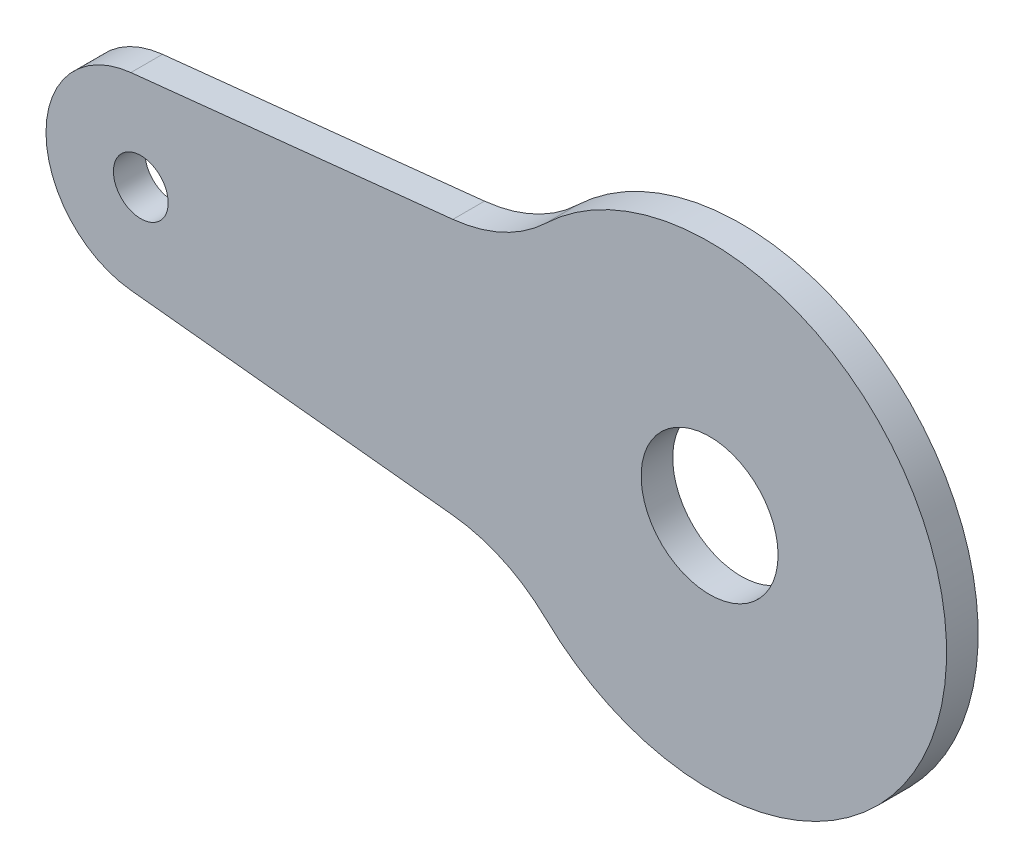
ISO-10303-21;
HEADER;
FILE_DESCRIPTION(('STEP AP214'),'2;1');
FILE_NAME('part.step','',(''),(''),'','','');
FILE_SCHEMA(('AUTOMOTIVE_DESIGN { 1 0 10303 214 1 1 1 1 }'));
ENDSEC;
DATA;
#1=APPLICATION_CONTEXT('core data for automotive mechanical design processes');
#2=APPLICATION_PROTOCOL_DEFINITION('international standard','automotive_design',2000,#1);
#3=PRODUCT_CONTEXT('',#1,'mechanical');
#4=PRODUCT('Part','Part','',(#3));
#5=PRODUCT_RELATED_PRODUCT_CATEGORY('part','',(#4));
#6=PRODUCT_DEFINITION_FORMATION('','',#4);
#7=PRODUCT_DEFINITION_CONTEXT('part definition',#1,'design');
#8=PRODUCT_DEFINITION('design','',#6,#7);
#9=PRODUCT_DEFINITION_SHAPE('','',#8);
#10=(LENGTH_UNIT() NAMED_UNIT(*) SI_UNIT(.MILLI.,.METRE.));
#11=(NAMED_UNIT(*) PLANE_ANGLE_UNIT() SI_UNIT($,.RADIAN.));
#12=(NAMED_UNIT(*) SI_UNIT($,.STERADIAN.) SOLID_ANGLE_UNIT());
#13=UNCERTAINTY_MEASURE_WITH_UNIT(LENGTH_MEASURE(1.E-05),#10,'distance_accuracy_value','');
#14=(GEOMETRIC_REPRESENTATION_CONTEXT(3) GLOBAL_UNCERTAINTY_ASSIGNED_CONTEXT((#13)) GLOBAL_UNIT_ASSIGNED_CONTEXT((#10,
#11,#12)) REPRESENTATION_CONTEXT('',''));
#15=CARTESIAN_POINT('',(0.,0.,0.));
#16=DIRECTION('',(0.,0.,1.));
#17=DIRECTION('',(1.,0.,0.));
#18=AXIS2_PLACEMENT_3D('',#15,#16,#17);
#19=CARTESIAN_POINT('',(-54.9407561694089,-8.95069705831446,5.));
#20=DIRECTION('',(0.104528463267653,0.994521895368273,0.));
#21=DIRECTION('',(-0.994521895368273,0.104528463267653,0.));
#22=AXIS2_PLACEMENT_3D('',#19,#20,#21);
#23=PLANE('',#22);
#24=DIRECTION('',(0.994521895368273,-0.104528463267653,0.));
#25=VECTOR('',#24,1.);
#26=CARTESIAN_POINT('',(-54.9407561694089,-8.95069705831446,0.));
#27=LINE('',#26,#25);
#28=CARTESIAN_POINT('',(-54.9407561694089,-8.95069705831446,0.));
#29=VERTEX_POINT('',#28);
#30=CARTESIAN_POINT('',(-24.3712697513505,-12.163679550749,0.));
#31=VERTEX_POINT('',#30);
#32=EDGE_CURVE('E112',#29,#31,#27,.T.);
#33=ORIENTED_EDGE('',*,*,#32,.T.);
#34=DIRECTION('',(0.,0.,1.));
#35=VECTOR('',#34,1.);
#36=CARTESIAN_POINT('',(-24.3712697513505,-12.163679550749,5.));
#37=LINE('',#36,#35);
#38=CARTESIAN_POINT('',(-24.3712697513505,-12.163679550749,3.));
#39=VERTEX_POINT('',#38);
#40=EDGE_CURVE('E89',#31,#39,#37,.T.);
#41=ORIENTED_EDGE('',*,*,#40,.T.);
#42=DIRECTION('',(-0.994521895368273,0.104528463267653,0.));
#43=VECTOR('',#42,1.);
#44=CARTESIAN_POINT('',(-54.9407561694089,-8.95069705831446,3.));
#45=LINE('',#44,#43);
#46=CARTESIAN_POINT('',(-54.9407561694089,-8.95069705831446,3.));
#47=VERTEX_POINT('',#46);
#48=EDGE_CURVE('E85',#39,#47,#45,.T.);
#49=ORIENTED_EDGE('',*,*,#48,.T.);
#50=DIRECTION('',(0.,0.,1.));
#51=VECTOR('',#50,1.);
#52=CARTESIAN_POINT('',(-54.9407561694089,-8.95069705831446,5.));
#53=LINE('',#52,#51);
#54=EDGE_CURVE('E88',#29,#47,#53,.T.);
#55=ORIENTED_EDGE('',*,*,#54,.F.);
#56=EDGE_LOOP('',(#33,#41,#49,#55));
#57=FACE_BOUND('',#56,.T.);
#58=ADVANCED_FACE('F33',(#57),#23,.F.);
#59=CARTESIAN_POINT('',(-54.9407561694089,8.95069705831445,5.));
#60=DIRECTION('',(0.104528463267654,-0.994521895368273,0.));
#61=DIRECTION('',(0.994521895368273,0.104528463267654,0.));
#62=AXIS2_PLACEMENT_3D('',#59,#60,#61);
#63=PLANE('',#62);
#64=DIRECTION('',(0.994521895368273,0.104528463267654,0.));
#65=VECTOR('',#64,1.);
#66=CARTESIAN_POINT('',(-54.9407561694089,8.95069705831445,3.));
#67=LINE('',#66,#65);
#68=CARTESIAN_POINT('',(-54.9407561694089,8.95069705831446,3.));
#69=VERTEX_POINT('',#68);
#70=CARTESIAN_POINT('',(-24.3712697513505,12.163679550749,3.));
#71=VERTEX_POINT('',#70);
#72=EDGE_CURVE('E91',#69,#71,#67,.T.);
#73=ORIENTED_EDGE('',*,*,#72,.T.);
#74=DIRECTION('',(0.,0.,1.));
#75=VECTOR('',#74,1.);
#76=CARTESIAN_POINT('',(-24.3712697513505,12.163679550749,5.));
#77=LINE('',#76,#75);
#78=CARTESIAN_POINT('',(-24.3712697513505,12.163679550749,0.));
#79=VERTEX_POINT('',#78);
#80=EDGE_CURVE('E100',#71,#79,#77,.F.);
#81=ORIENTED_EDGE('',*,*,#80,.T.);
#82=DIRECTION('',(-0.994521895368273,-0.104528463267654,0.));
#83=VECTOR('',#82,1.);
#84=CARTESIAN_POINT('',(-15.0197081139881,13.1465682851838,0.));
#85=LINE('',#84,#83);
#86=CARTESIAN_POINT('',(-54.9407561694089,8.95069705831446,0.));
#87=VERTEX_POINT('',#86);
#88=EDGE_CURVE('E101',#79,#87,#85,.T.);
#89=ORIENTED_EDGE('',*,*,#88,.T.);
#90=DIRECTION('',(0.,0.,-1.));
#91=VECTOR('',#90,1.);
#92=CARTESIAN_POINT('',(-54.9407561694089,8.95069705831446,5.));
#93=LINE('',#92,#91);
#94=EDGE_CURVE('E107',#69,#87,#93,.T.);
#95=ORIENTED_EDGE('',*,*,#94,.F.);
#96=EDGE_LOOP('',(#73,#81,#89,#95));
#97=FACE_BOUND('',#96,.T.);
#98=ADVANCED_FACE('F153',(#97),#63,.F.);
#99=CARTESIAN_POINT('',(-54.,0.,5.));
#100=DIRECTION('',(0.,0.,-1.));
#101=DIRECTION('',(-1.,0.,0.));
#102=AXIS2_PLACEMENT_3D('',#99,#100,#101);
#103=CYLINDRICAL_SURFACE('',#102,9.);
#104=CARTESIAN_POINT('',(-54.,0.,3.));
#105=DIRECTION('',(0.,0.,-1.));
#106=DIRECTION('',(-1.,0.,0.));
#107=AXIS2_PLACEMENT_3D('',#104,#105,#106);
#108=CIRCLE('',#107,9.);
#109=EDGE_CURVE('E94',#69,#47,#108,.F.);
#110=ORIENTED_EDGE('',*,*,#109,.F.);
#111=ORIENTED_EDGE('',*,*,#94,.T.);
#112=CARTESIAN_POINT('',(-54.,0.,0.));
#113=DIRECTION('',(0.,0.,-1.));
#114=DIRECTION('',(-1.,0.,0.));
#115=AXIS2_PLACEMENT_3D('',#112,#113,#114);
#116=CIRCLE('',#115,9.);
#117=EDGE_CURVE('E106',#87,#29,#116,.F.);
#118=ORIENTED_EDGE('',*,*,#117,.T.);
#119=ORIENTED_EDGE('',*,*,#54,.T.);
#120=EDGE_LOOP('',(#110,#111,#118,#119));
#121=FACE_BOUND('',#120,.T.);
#122=ADVANCED_FACE('F104',(#121),#103,.T.);
#123=CARTESIAN_POINT('',(-54.,0.,0.));
#124=DIRECTION('',(0.,0.,1.));
#125=DIRECTION('',(1.,0.,0.));
#126=AXIS2_PLACEMENT_3D('',#123,#124,#125);
#127=PLANE('',#126);
#128=CARTESIAN_POINT('',(0.,0.,0.));
#129=DIRECTION('',(0.,0.,1.));
#130=DIRECTION('',(1.,0.,0.));
#131=AXIS2_PLACEMENT_3D('',#128,#129,#130);
#132=CIRCLE('',#131,6.5);
#133=CARTESIAN_POINT('',(6.5,0.,0.));
#134=VERTEX_POINT('',#133);
#135=EDGE_CURVE('E237',#134,#134,#132,.T.);
#136=ORIENTED_EDGE('',*,*,#135,.T.);
#137=EDGE_LOOP('',(#136));
#138=FACE_BOUND('',#137,.T.);
#139=CARTESIAN_POINT('',(-54.,0.,0.));
#140=DIRECTION('',(0.,0.,1.));
#141=DIRECTION('',(1.,0.,0.));
#142=AXIS2_PLACEMENT_3D('',#139,#140,#141);
#143=CIRCLE('',#142,2.6);
#144=CARTESIAN_POINT('',(-51.4,0.,0.));
#145=VERTEX_POINT('',#144);
#146=EDGE_CURVE('E133',#145,#145,#143,.T.);
#147=ORIENTED_EDGE('',*,*,#146,.T.);
#148=EDGE_LOOP('',(#147));
#149=FACE_BOUND('',#148,.T.);
#150=ORIENTED_EDGE('',*,*,#88,.F.);
#151=CARTESIAN_POINT('',(-25.9391967003653,27.0815079812731,0.));
#152=DIRECTION('',(0.,0.,1.));
#153=DIRECTION('',(1.,0.,0.));
#154=AXIS2_PLACEMENT_3D('',#151,#152,#153);
#155=CIRCLE('',#154,15.);
#156=CARTESIAN_POINT('',(-15.5635180202192,16.2489047887639,0.));
#157=VERTEX_POINT('',#156);
#158=EDGE_CURVE('E121',#79,#157,#155,.T.);
#159=ORIENTED_EDGE('',*,*,#158,.T.);
#160=CARTESIAN_POINT('',(0.,0.,0.));
#161=DIRECTION('',(0.,0.,1.));
#162=DIRECTION('',(1.,0.,0.));
#163=AXIS2_PLACEMENT_3D('',#160,#161,#162);
#164=CIRCLE('',#163,22.5);
#165=CARTESIAN_POINT('',(-15.5635180202192,-16.2489047887638,0.));
#166=VERTEX_POINT('',#165);
#167=EDGE_CURVE('E132',#166,#157,#164,.T.);
#168=ORIENTED_EDGE('',*,*,#167,.F.);
#169=CARTESIAN_POINT('',(-25.9391967003653,-27.0815079812731,0.));
#170=DIRECTION('',(0.,0.,1.));
#171=DIRECTION('',(1.,0.,0.));
#172=AXIS2_PLACEMENT_3D('',#169,#170,#171);
#173=CIRCLE('',#172,15.);
#174=EDGE_CURVE('E11',#166,#31,#173,.T.);
#175=ORIENTED_EDGE('',*,*,#174,.T.);
#176=ORIENTED_EDGE('',*,*,#32,.F.);
#177=ORIENTED_EDGE('',*,*,#117,.F.);
#178=EDGE_LOOP('',(#150,#159,#168,#175,#176,#177));
#179=FACE_BOUND('',#178,.T.);
#180=ADVANCED_FACE('F142',(#138,#149,#179),#127,.F.);
#181=CARTESIAN_POINT('',(0.,0.,3.));
#182=DIRECTION('',(0.,0.,-1.));
#183=DIRECTION('',(-1.,0.,0.));
#184=AXIS2_PLACEMENT_3D('',#181,#182,#183);
#185=PLANE('',#184);
#186=CARTESIAN_POINT('',(0.,0.,3.));
#187=DIRECTION('',(0.,0.,1.));
#188=DIRECTION('',(1.,0.,0.));
#189=AXIS2_PLACEMENT_3D('',#186,#187,#188);
#190=CIRCLE('',#189,6.5);
#191=CARTESIAN_POINT('',(6.5,0.,3.));
#192=VERTEX_POINT('',#191);
#193=EDGE_CURVE('E240',#192,#192,#190,.T.);
#194=ORIENTED_EDGE('',*,*,#193,.F.);
#195=EDGE_LOOP('',(#194));
#196=FACE_BOUND('',#195,.T.);
#197=CARTESIAN_POINT('',(-54.,0.,3.));
#198=DIRECTION('',(0.,0.,1.));
#199=DIRECTION('',(1.,0.,0.));
#200=AXIS2_PLACEMENT_3D('',#197,#198,#199);
#201=CIRCLE('',#200,2.6);
#202=CARTESIAN_POINT('',(-51.4,0.,3.));
#203=VERTEX_POINT('',#202);
#204=EDGE_CURVE('E235',#203,#203,#201,.T.);
#205=ORIENTED_EDGE('',*,*,#204,.F.);
#206=EDGE_LOOP('',(#205));
#207=FACE_BOUND('',#206,.T.);
#208=ORIENTED_EDGE('',*,*,#48,.F.);
#209=CARTESIAN_POINT('',(-25.9391967003653,-27.0815079812731,3.));
#210=DIRECTION('',(0.,0.,-1.));
#211=DIRECTION('',(-1.,0.,0.));
#212=AXIS2_PLACEMENT_3D('',#209,#210,#211);
#213=CIRCLE('',#212,15.);
#214=CARTESIAN_POINT('',(-15.5635180202192,-16.2489047887638,3.));
#215=VERTEX_POINT('',#214);
#216=EDGE_CURVE('E41',#39,#215,#213,.T.);
#217=ORIENTED_EDGE('',*,*,#216,.T.);
#218=CARTESIAN_POINT('',(0.,0.,3.));
#219=DIRECTION('',(0.,0.,1.));
#220=DIRECTION('',(1.,0.,0.));
#221=AXIS2_PLACEMENT_3D('',#218,#219,#220);
#222=CIRCLE('',#221,22.5);
#223=CARTESIAN_POINT('',(-15.5635180202192,16.2489047887639,3.));
#224=VERTEX_POINT('',#223);
#225=EDGE_CURVE('E126',#215,#224,#222,.T.);
#226=ORIENTED_EDGE('',*,*,#225,.T.);
#227=CARTESIAN_POINT('',(-25.9391967003653,27.0815079812731,3.));
#228=DIRECTION('',(0.,0.,-1.));
#229=DIRECTION('',(-1.,0.,0.));
#230=AXIS2_PLACEMENT_3D('',#227,#228,#229);
#231=CIRCLE('',#230,15.);
#232=EDGE_CURVE('E123',#224,#71,#231,.T.);
#233=ORIENTED_EDGE('',*,*,#232,.T.);
#234=ORIENTED_EDGE('',*,*,#72,.F.);
#235=ORIENTED_EDGE('',*,*,#109,.T.);
#236=EDGE_LOOP('',(#208,#217,#226,#233,#234,#235));
#237=FACE_BOUND('',#236,.T.);
#238=ADVANCED_FACE('F95',(#196,#207,#237),#185,.F.);
#239=CARTESIAN_POINT('',(0.,0.,0.));
#240=DIRECTION('',(0.,0.,1.));
#241=DIRECTION('',(1.,0.,0.));
#242=AXIS2_PLACEMENT_3D('',#239,#240,#241);
#243=CYLINDRICAL_SURFACE('',#242,22.5);
#244=ORIENTED_EDGE('',*,*,#167,.T.);
#245=DIRECTION('',(0.,0.,1.));
#246=VECTOR('',#245,1.);
#247=CARTESIAN_POINT('',(-15.5635180202192,16.2489047887639,0.));
#248=LINE('',#247,#246);
#249=EDGE_CURVE('E118',#157,#224,#248,.T.);
#250=ORIENTED_EDGE('',*,*,#249,.T.);
#251=ORIENTED_EDGE('',*,*,#225,.F.);
#252=DIRECTION('',(0.,0.,1.));
#253=VECTOR('',#252,1.);
#254=CARTESIAN_POINT('',(-15.5635180202192,-16.2489047887638,0.));
#255=LINE('',#254,#253);
#256=EDGE_CURVE('E116',#215,#166,#255,.F.);
#257=ORIENTED_EDGE('',*,*,#256,.T.);
#258=EDGE_LOOP('',(#244,#250,#251,#257));
#259=FACE_BOUND('',#258,.T.);
#260=ADVANCED_FACE('F130',(#259),#243,.T.);
#261=CARTESIAN_POINT('',(-54.,0.,0.));
#262=DIRECTION('',(0.,0.,1.));
#263=DIRECTION('',(1.,0.,0.));
#264=AXIS2_PLACEMENT_3D('',#261,#262,#263);
#265=CYLINDRICAL_SURFACE('',#264,2.6);
#266=ORIENTED_EDGE('',*,*,#146,.F.);
#267=EDGE_LOOP('',(#266));
#268=FACE_BOUND('',#267,.T.);
#269=ORIENTED_EDGE('',*,*,#204,.T.);
#270=EDGE_LOOP('',(#269));
#271=FACE_BOUND('',#270,.T.);
#272=ADVANCED_FACE('F196',(#268,#271),#265,.F.);
#273=CARTESIAN_POINT('',(0.,0.,0.));
#274=DIRECTION('',(0.,0.,1.));
#275=DIRECTION('',(1.,0.,0.));
#276=AXIS2_PLACEMENT_3D('',#273,#274,#275);
#277=CYLINDRICAL_SURFACE('',#276,6.5);
#278=ORIENTED_EDGE('',*,*,#135,.F.);
#279=EDGE_LOOP('',(#278));
#280=FACE_BOUND('',#279,.T.);
#281=ORIENTED_EDGE('',*,*,#193,.T.);
#282=EDGE_LOOP('',(#281));
#283=FACE_BOUND('',#282,.T.);
#284=ADVANCED_FACE('F140',(#280,#283),#277,.F.);
#285=CARTESIAN_POINT('',(-25.9391967003653,27.0815079812731,0.));
#286=DIRECTION('',(0.,0.,1.));
#287=DIRECTION('',(1.,0.,0.));
#288=AXIS2_PLACEMENT_3D('',#285,#286,#287);
#289=CYLINDRICAL_SURFACE('',#288,15.);
#290=ORIENTED_EDGE('',*,*,#232,.F.);
#291=ORIENTED_EDGE('',*,*,#249,.F.);
#292=ORIENTED_EDGE('',*,*,#158,.F.);
#293=ORIENTED_EDGE('',*,*,#80,.F.);
#294=EDGE_LOOP('',(#290,#291,#292,#293));
#295=FACE_BOUND('',#294,.T.);
#296=ADVANCED_FACE('F136',(#295),#289,.F.);
#297=CARTESIAN_POINT('',(-25.9391967003653,-27.0815079812731,0.));
#298=DIRECTION('',(0.,0.,1.));
#299=DIRECTION('',(1.,0.,0.));
#300=AXIS2_PLACEMENT_3D('',#297,#298,#299);
#301=CYLINDRICAL_SURFACE('',#300,15.);
#302=ORIENTED_EDGE('',*,*,#174,.F.);
#303=ORIENTED_EDGE('',*,*,#256,.F.);
#304=ORIENTED_EDGE('',*,*,#216,.F.);
#305=ORIENTED_EDGE('',*,*,#40,.F.);
#306=EDGE_LOOP('',(#302,#303,#304,#305));
#307=FACE_BOUND('',#306,.T.);
#308=ADVANCED_FACE('F35',(#307),#301,.F.);
#309=CLOSED_SHELL('',(#58,#98,#122,#180,#238,#260,#272,#284,#296,#308));
#310=MANIFOLD_SOLID_BREP('B2',#309);
#311=ADVANCED_BREP_SHAPE_REPRESENTATION('',(#18,#310),#14);
#312=SHAPE_DEFINITION_REPRESENTATION(#9,#311);
ENDSEC;
END-ISO-10303-21;
